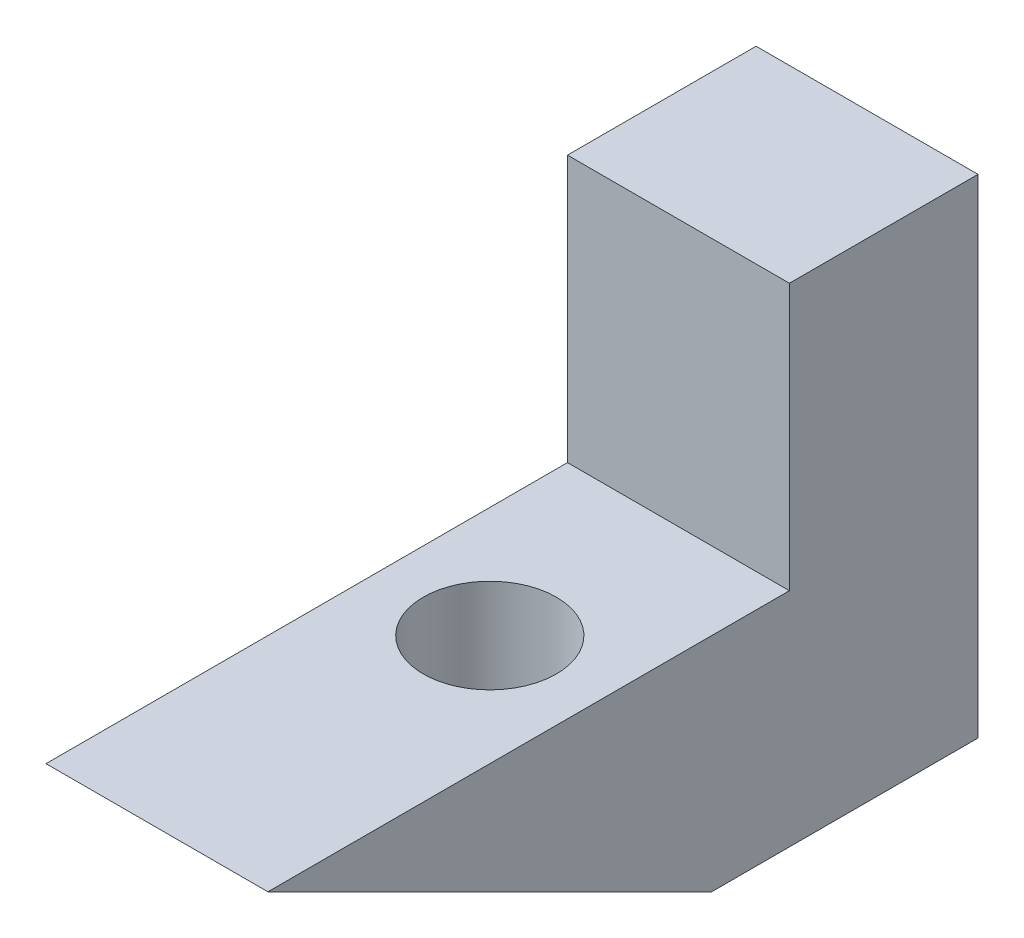
ISO-10303-21;
HEADER;
FILE_DESCRIPTION(('STEP AP214'),'2;1');
FILE_NAME('part.step','',(''),(''),'','','');
FILE_SCHEMA(('AUTOMOTIVE_DESIGN { 1 0 10303 214 1 1 1 1 }'));
ENDSEC;
DATA;
#1=APPLICATION_CONTEXT('core data for automotive mechanical design processes');
#2=APPLICATION_PROTOCOL_DEFINITION('international standard','automotive_design',2000,#1);
#3=PRODUCT_CONTEXT('',#1,'mechanical');
#4=PRODUCT('Part','Part','',(#3));
#5=PRODUCT_RELATED_PRODUCT_CATEGORY('part','',(#4));
#6=PRODUCT_DEFINITION_FORMATION('','',#4);
#7=PRODUCT_DEFINITION_CONTEXT('part definition',#1,'design');
#8=PRODUCT_DEFINITION('design','',#6,#7);
#9=PRODUCT_DEFINITION_SHAPE('','',#8);
#10=(LENGTH_UNIT() NAMED_UNIT(*) SI_UNIT(.MILLI.,.METRE.));
#11=(NAMED_UNIT(*) PLANE_ANGLE_UNIT() SI_UNIT($,.RADIAN.));
#12=(NAMED_UNIT(*) SI_UNIT($,.STERADIAN.) SOLID_ANGLE_UNIT());
#13=UNCERTAINTY_MEASURE_WITH_UNIT(LENGTH_MEASURE(1.E-05),#10,'distance_accuracy_value','');
#14=(GEOMETRIC_REPRESENTATION_CONTEXT(3) GLOBAL_UNCERTAINTY_ASSIGNED_CONTEXT((#13)) GLOBAL_UNIT_ASSIGNED_CONTEXT((#10,
#11,#12)) REPRESENTATION_CONTEXT('',''));
#15=CARTESIAN_POINT('',(0.,0.,0.));
#16=DIRECTION('',(0.,0.,1.));
#17=DIRECTION('',(1.,0.,0.));
#18=AXIS2_PLACEMENT_3D('',#15,#16,#17);
#19=CARTESIAN_POINT('',(10.,0.,0.));
#20=DIRECTION('',(1.,0.,0.));
#21=DIRECTION('',(0.,0.,-1.));
#22=AXIS2_PLACEMENT_3D('',#19,#20,#21);
#23=PLANE('',#22);
#24=DIRECTION('',(0.,0.,1.));
#25=VECTOR('',#24,1.);
#26=CARTESIAN_POINT('',(10.,17.2193384048277,-96.));
#27=LINE('',#26,#25);
#28=CARTESIAN_POINT('',(10.,17.2193384048277,-119.5));
#29=VERTEX_POINT('',#28);
#30=CARTESIAN_POINT('',(10.,17.2193384048277,-96.));
#31=VERTEX_POINT('',#30);
#32=EDGE_CURVE('E119',#29,#31,#27,.T.);
#33=ORIENTED_EDGE('',*,*,#32,.T.);
#34=DIRECTION('',(0.,-0.447213595499958,-0.894427190999916));
#35=VECTOR('',#34,1.);
#36=CARTESIAN_POINT('',(10.,52.1754707238622,-26.0877353619311));
#37=LINE('',#36,#35);
#38=CARTESIAN_POINT('',(10.,7.21933840482774,-116.));
#39=VERTEX_POINT('',#38);
#40=EDGE_CURVE('E68',#31,#39,#37,.T.);
#41=ORIENTED_EDGE('',*,*,#40,.T.);
#42=DIRECTION('',(0.,0.,-1.));
#43=VECTOR('',#42,1.);
#44=CARTESIAN_POINT('',(10.,7.21933840482774,-96.));
#45=LINE('',#44,#43);
#46=CARTESIAN_POINT('',(10.,7.21933840482774,-128.));
#47=VERTEX_POINT('',#46);
#48=EDGE_CURVE('E112',#39,#47,#45,.T.);
#49=ORIENTED_EDGE('',*,*,#48,.T.);
#50=DIRECTION('',(0.,1.,0.));
#51=VECTOR('',#50,1.);
#52=CARTESIAN_POINT('',(10.,7.21933840482774,-128.));
#53=LINE('',#52,#51);
#54=CARTESIAN_POINT('',(10.,29.2193384048277,-128.));
#55=VERTEX_POINT('',#54);
#56=EDGE_CURVE('E146',#47,#55,#53,.T.);
#57=ORIENTED_EDGE('',*,*,#56,.T.);
#58=DIRECTION('',(0.,0.,-1.));
#59=VECTOR('',#58,1.);
#60=CARTESIAN_POINT('',(10.,29.2193384048277,-121.));
#61=LINE('',#60,#59);
#62=CARTESIAN_POINT('',(10.,29.2193384048277,-119.5));
#63=VERTEX_POINT('',#62);
#64=EDGE_CURVE('E122',#63,#55,#61,.T.);
#65=ORIENTED_EDGE('',*,*,#64,.F.);
#66=DIRECTION('',(0.,-1.,0.));
#67=VECTOR('',#66,1.);
#68=CARTESIAN_POINT('',(10.,39.3312126129061,-119.5));
#69=LINE('',#68,#67);
#70=EDGE_CURVE('E138',#63,#29,#69,.T.);
#71=ORIENTED_EDGE('',*,*,#70,.T.);
#72=EDGE_LOOP('',(#33,#41,#49,#57,#65,#71));
#73=FACE_BOUND('',#72,.T.);
#74=ADVANCED_FACE('F46',(#73),#23,.T.);
#75=CARTESIAN_POINT('',(0.,0.,0.));
#76=DIRECTION('',(1.,0.,0.));
#77=DIRECTION('',(0.,0.,-1.));
#78=AXIS2_PLACEMENT_3D('',#75,#76,#77);
#79=PLANE('',#78);
#80=DIRECTION('',(0.,-0.447213595499958,-0.894427190999916));
#81=VECTOR('',#80,1.);
#82=CARTESIAN_POINT('',(0.,52.1754707238622,-26.0877353619311));
#83=LINE('',#82,#81);
#84=CARTESIAN_POINT('',(0.,17.2193384048277,-96.));
#85=VERTEX_POINT('',#84);
#86=CARTESIAN_POINT('',(0.,7.21933840482774,-116.));
#87=VERTEX_POINT('',#86);
#88=EDGE_CURVE('E97',#85,#87,#83,.T.);
#89=ORIENTED_EDGE('',*,*,#88,.F.);
#90=DIRECTION('',(0.,0.,1.));
#91=VECTOR('',#90,1.);
#92=CARTESIAN_POINT('',(0.,17.2193384048277,-96.));
#93=LINE('',#92,#91);
#94=CARTESIAN_POINT('',(0.,17.2193384048277,-119.5));
#95=VERTEX_POINT('',#94);
#96=EDGE_CURVE('E116',#95,#85,#93,.T.);
#97=ORIENTED_EDGE('',*,*,#96,.F.);
#98=DIRECTION('',(0.,-1.,0.));
#99=VECTOR('',#98,1.);
#100=CARTESIAN_POINT('',(0.,39.3312126129061,-119.5));
#101=LINE('',#100,#99);
#102=CARTESIAN_POINT('',(0.,29.2193384048277,-119.5));
#103=VERTEX_POINT('',#102);
#104=EDGE_CURVE('E141',#103,#95,#101,.T.);
#105=ORIENTED_EDGE('',*,*,#104,.F.);
#106=DIRECTION('',(0.,0.,-1.));
#107=VECTOR('',#106,1.);
#108=CARTESIAN_POINT('',(0.,29.2193384048277,-121.));
#109=LINE('',#108,#107);
#110=CARTESIAN_POINT('',(0.,29.2193384048277,-128.));
#111=VERTEX_POINT('',#110);
#112=EDGE_CURVE('E128',#103,#111,#109,.T.);
#113=ORIENTED_EDGE('',*,*,#112,.T.);
#114=DIRECTION('',(0.,1.,0.));
#115=VECTOR('',#114,1.);
#116=CARTESIAN_POINT('',(0.,7.21933840482774,-128.));
#117=LINE('',#116,#115);
#118=CARTESIAN_POINT('',(0.,7.21933840482774,-128.));
#119=VERTEX_POINT('',#118);
#120=EDGE_CURVE('E60',#119,#111,#117,.T.);
#121=ORIENTED_EDGE('',*,*,#120,.F.);
#122=DIRECTION('',(0.,0.,-1.));
#123=VECTOR('',#122,1.);
#124=CARTESIAN_POINT('',(0.,7.21933840482774,-96.));
#125=LINE('',#124,#123);
#126=EDGE_CURVE('E111',#87,#119,#125,.T.);
#127=ORIENTED_EDGE('',*,*,#126,.F.);
#128=EDGE_LOOP('',(#89,#97,#105,#113,#121,#127));
#129=FACE_BOUND('',#128,.T.);
#130=ADVANCED_FACE('F48',(#129),#79,.F.);
#131=CARTESIAN_POINT('',(0.,7.21933840482774,0.));
#132=DIRECTION('',(0.,1.,0.));
#133=DIRECTION('',(0.,0.,1.));
#134=AXIS2_PLACEMENT_3D('',#131,#132,#133);
#135=PLANE('',#134);
#136=DIRECTION('',(1.,0.,0.));
#137=VECTOR('',#136,1.);
#138=CARTESIAN_POINT('',(0.,7.21933840482774,-116.));
#139=LINE('',#138,#137);
#140=EDGE_CURVE('E100',#87,#39,#139,.T.);
#141=ORIENTED_EDGE('',*,*,#140,.F.);
#142=ORIENTED_EDGE('',*,*,#126,.T.);
#143=DIRECTION('',(1.,0.,0.));
#144=VECTOR('',#143,1.);
#145=CARTESIAN_POINT('',(0.,7.21933840482774,-128.));
#146=LINE('',#145,#144);
#147=EDGE_CURVE('E113',#119,#47,#146,.T.);
#148=ORIENTED_EDGE('',*,*,#147,.T.);
#149=ORIENTED_EDGE('',*,*,#48,.F.);
#150=EDGE_LOOP('',(#141,#142,#148,#149));
#151=FACE_BOUND('',#150,.T.);
#152=ADVANCED_FACE('F109',(#151),#135,.F.);
#153=CARTESIAN_POINT('',(0.,17.2193384048277,-96.));
#154=DIRECTION('',(0.,-1.,0.));
#155=DIRECTION('',(0.,0.,1.));
#156=AXIS2_PLACEMENT_3D('',#153,#154,#155);
#157=PLANE('',#156);
#158=CARTESIAN_POINT('',(5.,17.2193384048278,-111.));
#159=DIRECTION('',(0.,-1.,0.));
#160=DIRECTION('',(0.,0.,-1.));
#161=AXIS2_PLACEMENT_3D('',#158,#159,#160);
#162=CIRCLE('',#161,3.);
#163=CARTESIAN_POINT('',(5.,17.2193384048278,-114.));
#164=VERTEX_POINT('',#163);
#165=EDGE_CURVE('E126',#164,#164,#162,.T.);
#166=ORIENTED_EDGE('',*,*,#165,.T.);
#167=EDGE_LOOP('',(#166));
#168=FACE_BOUND('',#167,.T.);
#169=ORIENTED_EDGE('',*,*,#32,.F.);
#170=DIRECTION('',(-1.,0.,0.));
#171=VECTOR('',#170,1.);
#172=CARTESIAN_POINT('',(0.,17.2193384048277,-119.5));
#173=LINE('',#172,#171);
#174=EDGE_CURVE('E133',#29,#95,#173,.T.);
#175=ORIENTED_EDGE('',*,*,#174,.T.);
#176=ORIENTED_EDGE('',*,*,#96,.T.);
#177=DIRECTION('',(1.,0.,0.));
#178=VECTOR('',#177,1.);
#179=CARTESIAN_POINT('',(0.,17.2193384048277,-96.));
#180=LINE('',#179,#178);
#181=EDGE_CURVE('E54',#85,#31,#180,.T.);
#182=ORIENTED_EDGE('',*,*,#181,.T.);
#183=EDGE_LOOP('',(#169,#175,#176,#182));
#184=FACE_BOUND('',#183,.T.);
#185=ADVANCED_FACE('F158',(#168,#184),#157,.F.);
#186=CARTESIAN_POINT('',(0.,29.2193384048277,-96.));
#187=DIRECTION('',(0.,1.,0.));
#188=DIRECTION('',(0.,0.,-1.));
#189=AXIS2_PLACEMENT_3D('',#186,#187,#188);
#190=PLANE('',#189);
#191=DIRECTION('',(1.,0.,0.));
#192=VECTOR('',#191,1.);
#193=CARTESIAN_POINT('',(0.,29.2193384048277,-128.));
#194=LINE('',#193,#192);
#195=EDGE_CURVE('E11',#111,#55,#194,.T.);
#196=ORIENTED_EDGE('',*,*,#195,.F.);
#197=ORIENTED_EDGE('',*,*,#112,.F.);
#198=DIRECTION('',(-1.,0.,0.));
#199=VECTOR('',#198,1.);
#200=CARTESIAN_POINT('',(0.,29.2193384048277,-119.5));
#201=LINE('',#200,#199);
#202=EDGE_CURVE('E143',#63,#103,#201,.T.);
#203=ORIENTED_EDGE('',*,*,#202,.F.);
#204=ORIENTED_EDGE('',*,*,#64,.T.);
#205=EDGE_LOOP('',(#196,#197,#203,#204));
#206=FACE_BOUND('',#205,.T.);
#207=ADVANCED_FACE('F165',(#206),#190,.T.);
#208=CARTESIAN_POINT('',(5.,149.85,-111.));
#209=DIRECTION('',(0.,-1.,0.));
#210=DIRECTION('',(0.,0.,-1.));
#211=AXIS2_PLACEMENT_3D('',#208,#209,#210);
#212=CYLINDRICAL_SURFACE('',#211,3.);
#213=CARTESIAN_POINT('',(5.,12.2193384048277,-111.));
#214=DIRECTION('',(0.,-1.,0.));
#215=DIRECTION('',(0.,0.,-1.));
#216=AXIS2_PLACEMENT_3D('',#213,#214,#215);
#217=CIRCLE('',#216,3.);
#218=CARTESIAN_POINT('',(5.,12.2193384048277,-114.));
#219=VERTEX_POINT('',#218);
#220=EDGE_CURVE('E129',#219,#219,#217,.T.);
#221=ORIENTED_EDGE('',*,*,#220,.T.);
#222=EDGE_LOOP('',(#221));
#223=FACE_BOUND('',#222,.T.);
#224=ORIENTED_EDGE('',*,*,#165,.F.);
#225=EDGE_LOOP('',(#224));
#226=FACE_BOUND('',#225,.T.);
#227=ADVANCED_FACE('F187',(#223,#226),#212,.F.);
#228=CARTESIAN_POINT('',(5.,12.2193384048277,-111.));
#229=DIRECTION('',(0.,1.,0.));
#230=DIRECTION('',(0.,0.,-1.));
#231=AXIS2_PLACEMENT_3D('',#228,#229,#230);
#232=PLANE('',#231);
#233=ORIENTED_EDGE('',*,*,#220,.F.);
#234=EDGE_LOOP('',(#233));
#235=FACE_BOUND('',#234,.T.);
#236=ADVANCED_FACE('F174',(#235),#232,.T.);
#237=CARTESIAN_POINT('',(0.,39.3312126129061,-119.5));
#238=DIRECTION('',(0.,0.,1.));
#239=DIRECTION('',(1.,0.,0.));
#240=AXIS2_PLACEMENT_3D('',#237,#238,#239);
#241=PLANE('',#240);
#242=ORIENTED_EDGE('',*,*,#70,.F.);
#243=ORIENTED_EDGE('',*,*,#202,.T.);
#244=ORIENTED_EDGE('',*,*,#104,.T.);
#245=ORIENTED_EDGE('',*,*,#174,.F.);
#246=EDGE_LOOP('',(#242,#243,#244,#245));
#247=FACE_BOUND('',#246,.T.);
#248=ADVANCED_FACE('F162',(#247),#241,.T.);
#249=CARTESIAN_POINT('',(0.,7.21933840482774,-128.));
#250=DIRECTION('',(0.,0.,1.));
#251=DIRECTION('',(1.,0.,0.));
#252=AXIS2_PLACEMENT_3D('',#249,#250,#251);
#253=PLANE('',#252);
#254=ORIENTED_EDGE('',*,*,#195,.T.);
#255=ORIENTED_EDGE('',*,*,#56,.F.);
#256=ORIENTED_EDGE('',*,*,#147,.F.);
#257=ORIENTED_EDGE('',*,*,#120,.T.);
#258=EDGE_LOOP('',(#254,#255,#256,#257));
#259=FACE_BOUND('',#258,.T.);
#260=ADVANCED_FACE('F166',(#259),#253,.F.);
#261=CARTESIAN_POINT('',(0.,52.1754707238622,-26.0877353619311));
#262=DIRECTION('',(0.,-0.894427190999916,0.447213595499958));
#263=DIRECTION('',(0.,-0.447213595499958,-0.894427190999916));
#264=AXIS2_PLACEMENT_3D('',#261,#262,#263);
#265=PLANE('',#264);
#266=ORIENTED_EDGE('',*,*,#40,.F.);
#267=ORIENTED_EDGE('',*,*,#181,.F.);
#268=ORIENTED_EDGE('',*,*,#88,.T.);
#269=ORIENTED_EDGE('',*,*,#140,.T.);
#270=EDGE_LOOP('',(#266,#267,#268,#269));
#271=FACE_BOUND('',#270,.T.);
#272=ADVANCED_FACE('F99',(#271),#265,.T.);
#273=CLOSED_SHELL('',(#74,#130,#152,#185,#207,#227,#236,#248,#260,#272));
#274=MANIFOLD_SOLID_BREP('B2',#273);
#275=ADVANCED_BREP_SHAPE_REPRESENTATION('',(#18,#274),#14);
#276=SHAPE_DEFINITION_REPRESENTATION(#9,#275);
ENDSEC;
END-ISO-10303-21;
